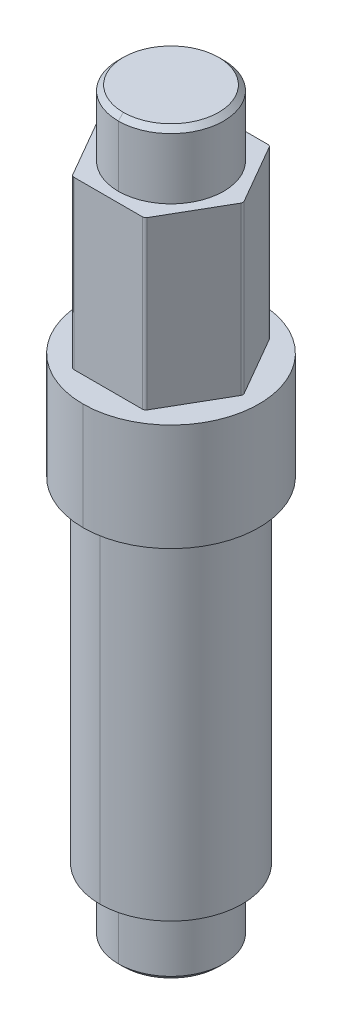
ISO-10303-21;
HEADER;
FILE_DESCRIPTION(('STEP AP214'),'2;1');
FILE_NAME('part.step','',(''),(''),'','','');
FILE_SCHEMA(('AUTOMOTIVE_DESIGN { 1 0 10303 214 1 1 1 1 }'));
ENDSEC;
DATA;
#1=APPLICATION_CONTEXT('core data for automotive mechanical design processes');
#2=APPLICATION_PROTOCOL_DEFINITION('international standard','automotive_design',2000,#1);
#3=PRODUCT_CONTEXT('',#1,'mechanical');
#4=PRODUCT('Part','Part','',(#3));
#5=PRODUCT_RELATED_PRODUCT_CATEGORY('part','',(#4));
#6=PRODUCT_DEFINITION_FORMATION('','',#4);
#7=PRODUCT_DEFINITION_CONTEXT('part definition',#1,'design');
#8=PRODUCT_DEFINITION('design','',#6,#7);
#9=PRODUCT_DEFINITION_SHAPE('','',#8);
#10=(LENGTH_UNIT() NAMED_UNIT(*) SI_UNIT(.MILLI.,.METRE.));
#11=(NAMED_UNIT(*) PLANE_ANGLE_UNIT() SI_UNIT($,.RADIAN.));
#12=(NAMED_UNIT(*) SI_UNIT($,.STERADIAN.) SOLID_ANGLE_UNIT());
#13=UNCERTAINTY_MEASURE_WITH_UNIT(LENGTH_MEASURE(1.E-05),#10,'distance_accuracy_value','');
#14=(GEOMETRIC_REPRESENTATION_CONTEXT(3) GLOBAL_UNCERTAINTY_ASSIGNED_CONTEXT((#13)) GLOBAL_UNIT_ASSIGNED_CONTEXT((#10,
#11,#12)) REPRESENTATION_CONTEXT('',''));
#15=CARTESIAN_POINT('',(0.,0.,0.));
#16=DIRECTION('',(0.,0.,1.));
#17=DIRECTION('',(1.,0.,0.));
#18=AXIS2_PLACEMENT_3D('',#15,#16,#17);
#19=CARTESIAN_POINT('',(0.,-4.618999906,0.));
#20=DIRECTION('',(0.,1.,0.));
#21=DIRECTION('',(0.,0.,1.));
#22=AXIS2_PLACEMENT_3D('',#19,#20,#21);
#23=CONICAL_SURFACE('',#22,4.000000001,0.78539816339745);
#24=DIRECTION('',(0.,0.707106781186546,-0.707106781186549));
#25=VECTOR('',#24,1.);
#26=CARTESIAN_POINT('',(0.,-4.618999906,-4.000000001));
#27=LINE('',#26,#25);
#28=CARTESIAN_POINT('',(0.,-4.999999906,-3.61900000099999));
#29=VERTEX_POINT('',#28);
#30=CARTESIAN_POINT('',(0.,-4.618999906,-4.000000001));
#31=VERTEX_POINT('',#30);
#32=EDGE_CURVE('E301',#29,#31,#27,.T.);
#33=ORIENTED_EDGE('',*,*,#32,.F.);
#34=CARTESIAN_POINT('',(0.,-4.999999906,0.));
#35=DIRECTION('',(0.,-1.,0.));
#36=DIRECTION('',(0.,0.,-1.));
#37=AXIS2_PLACEMENT_3D('',#34,#35,#36);
#38=CIRCLE('',#37,3.61900000099999);
#39=CARTESIAN_POINT('',(0.,-4.999999906,3.61900000099999));
#40=VERTEX_POINT('',#39);
#41=EDGE_CURVE('E255',#40,#29,#38,.T.);
#42=ORIENTED_EDGE('',*,*,#41,.F.);
#43=DIRECTION('',(0.,0.707106781186546,0.707106781186549));
#44=VECTOR('',#43,1.);
#45=CARTESIAN_POINT('',(0.,-4.618999906,4.000000001));
#46=LINE('',#45,#44);
#47=CARTESIAN_POINT('',(0.,-4.618999906,4.000000001));
#48=VERTEX_POINT('',#47);
#49=EDGE_CURVE('E264',#40,#48,#46,.T.);
#50=ORIENTED_EDGE('',*,*,#49,.T.);
#51=CARTESIAN_POINT('',(0.,-4.618999906,0.));
#52=DIRECTION('',(0.,1.,0.));
#53=DIRECTION('',(0.,0.,-1.));
#54=AXIS2_PLACEMENT_3D('',#51,#52,#53);
#55=CIRCLE('',#54,4.000000001);
#56=EDGE_CURVE('E235',#31,#48,#55,.T.);
#57=ORIENTED_EDGE('',*,*,#56,.F.);
#58=EDGE_LOOP('',(#33,#42,#50,#57));
#59=FACE_BOUND('',#58,.T.);
#60=ADVANCED_FACE('F16',(#59),#23,.T.);
#61=CARTESIAN_POINT('',(0.,51.177199906,0.));
#62=DIRECTION('',(0.,-1.,0.));
#63=DIRECTION('',(0.,0.,-1.));
#64=AXIS2_PLACEMENT_3D('',#61,#62,#63);
#65=CONICAL_SURFACE('',#64,3.61900000100001,0.785398163397453);
#66=DIRECTION('',(0.,-0.707106781186544,0.707106781186551));
#67=VECTOR('',#66,1.);
#68=CARTESIAN_POINT('',(0.,51.177199906,3.61900000100001));
#69=LINE('',#68,#67);
#70=CARTESIAN_POINT('',(0.,51.177199906,3.61900000100001));
#71=VERTEX_POINT('',#70);
#72=CARTESIAN_POINT('',(0.,50.796199906,4.000000001));
#73=VERTEX_POINT('',#72);
#74=EDGE_CURVE('E263',#71,#73,#69,.T.);
#75=ORIENTED_EDGE('',*,*,#74,.F.);
#76=CARTESIAN_POINT('',(0.,51.177199906,0.));
#77=DIRECTION('',(0.,1.,0.));
#78=DIRECTION('',(0.,0.,1.));
#79=AXIS2_PLACEMENT_3D('',#76,#77,#78);
#80=CIRCLE('',#79,3.61900000100001);
#81=CARTESIAN_POINT('',(0.,51.177199906,-3.61900000100001));
#82=VERTEX_POINT('',#81);
#83=EDGE_CURVE('E254',#82,#71,#80,.T.);
#84=ORIENTED_EDGE('',*,*,#83,.F.);
#85=DIRECTION('',(0.,-0.707106781186544,-0.707106781186551));
#86=VECTOR('',#85,1.);
#87=CARTESIAN_POINT('',(0.,51.177199906,-3.61900000100001));
#88=LINE('',#87,#86);
#89=CARTESIAN_POINT('',(0.,50.796199906,-4.000000001));
#90=VERTEX_POINT('',#89);
#91=EDGE_CURVE('E300',#82,#90,#88,.T.);
#92=ORIENTED_EDGE('',*,*,#91,.T.);
#93=CARTESIAN_POINT('',(0.,50.796199906,0.));
#94=DIRECTION('',(0.,-1.,0.));
#95=DIRECTION('',(0.,0.,1.));
#96=AXIS2_PLACEMENT_3D('',#93,#94,#95);
#97=CIRCLE('',#96,4.000000001);
#98=EDGE_CURVE('E11',#73,#90,#97,.T.);
#99=ORIENTED_EDGE('',*,*,#98,.F.);
#100=EDGE_LOOP('',(#75,#84,#92,#99));
#101=FACE_BOUND('',#100,.T.);
#102=ADVANCED_FACE('F513',(#101),#65,.T.);
#103=CARTESIAN_POINT('',(-6.6802,46.1772,0.));
#104=DIRECTION('',(0.,1.,0.));
#105=DIRECTION('',(1.,0.,0.));
#106=AXIS2_PLACEMENT_3D('',#103,#104,#105);
#107=PLANE('',#106);
#108=CARTESIAN_POINT('',(0.,46.1772,0.));
#109=DIRECTION('',(0.,1.,0.));
#110=DIRECTION('',(0.,0.,1.));
#111=AXIS2_PLACEMENT_3D('',#108,#109,#110);
#112=CIRCLE('',#111,4.000000001);
#113=CARTESIAN_POINT('',(0.,46.1772,4.000000001));
#114=VERTEX_POINT('',#113);
#115=CARTESIAN_POINT('',(0.,46.1772,-4.000000001));
#116=VERTEX_POINT('',#115);
#117=EDGE_CURVE('E295',#114,#116,#112,.T.);
#118=ORIENTED_EDGE('',*,*,#117,.F.);
#119=CARTESIAN_POINT('',(0.,46.1772,0.));
#120=DIRECTION('',(0.,1.,0.));
#121=DIRECTION('',(0.,0.,1.));
#122=AXIS2_PLACEMENT_3D('',#119,#120,#121);
#123=CIRCLE('',#122,4.000000001);
#124=EDGE_CURVE('E27',#116,#114,#123,.T.);
#125=ORIENTED_EDGE('',*,*,#124,.F.);
#126=EDGE_LOOP('',(#118,#125));
#127=FACE_BOUND('',#126,.T.);
#128=DIRECTION('',(0.5,0.,0.866025403784439));
#129=VECTOR('',#128,1.);
#130=CARTESIAN_POINT('',(-5.42593782984411,46.1772,0.127000000000003));
#131=LINE('',#130,#129);
#132=CARTESIAN_POINT('',(-5.42593782984411,46.1772,0.127000000000003));
#133=VERTEX_POINT('',#132);
#134=CARTESIAN_POINT('',(-2.82295414120268,46.1772,4.6355));
#135=VERTEX_POINT('',#134);
#136=EDGE_CURVE('E281',#133,#135,#131,.T.);
#137=ORIENTED_EDGE('',*,*,#136,.T.);
#138=CARTESIAN_POINT('',(-2.60298368864143,46.1772,4.5085));
#139=DIRECTION('',(0.,1.,0.));
#140=DIRECTION('',(0.,0.,1.));
#141=AXIS2_PLACEMENT_3D('',#138,#139,#140);
#142=CIRCLE('',#141,0.254);
#143=CARTESIAN_POINT('',(-2.60298368864143,46.1772,4.7625));
#144=VERTEX_POINT('',#143);
#145=EDGE_CURVE('E341',#135,#144,#142,.T.);
#146=ORIENTED_EDGE('',*,*,#145,.T.);
#147=DIRECTION('',(1.,0.,0.));
#148=VECTOR('',#147,1.);
#149=CARTESIAN_POINT('',(-2.60298368864143,46.1772,4.7625));
#150=LINE('',#149,#148);
#151=CARTESIAN_POINT('',(2.60298368864142,46.1772,4.7625));
#152=VERTEX_POINT('',#151);
#153=EDGE_CURVE('E42',#144,#152,#150,.T.);
#154=ORIENTED_EDGE('',*,*,#153,.T.);
#155=CARTESIAN_POINT('',(2.60298368864142,46.1772,4.5085));
#156=DIRECTION('',(0.,1.,0.));
#157=DIRECTION('',(0.,0.,1.));
#158=AXIS2_PLACEMENT_3D('',#155,#156,#157);
#159=CIRCLE('',#158,0.254);
#160=CARTESIAN_POINT('',(2.82295414120268,46.1772,4.6355));
#161=VERTEX_POINT('',#160);
#162=EDGE_CURVE('E318',#152,#161,#159,.T.);
#163=ORIENTED_EDGE('',*,*,#162,.T.);
#164=DIRECTION('',(0.5,0.,-0.866025403784439));
#165=VECTOR('',#164,1.);
#166=CARTESIAN_POINT('',(2.82295414120268,46.1772,4.6355));
#167=LINE('',#166,#165);
#168=CARTESIAN_POINT('',(5.4259378298441,46.1772,0.126999999999999));
#169=VERTEX_POINT('',#168);
#170=EDGE_CURVE('E330',#161,#169,#167,.T.);
#171=ORIENTED_EDGE('',*,*,#170,.T.);
#172=CARTESIAN_POINT('',(5.20596737728286,46.1772,0.));
#173=DIRECTION('',(0.,1.,0.));
#174=DIRECTION('',(0.,0.,1.));
#175=AXIS2_PLACEMENT_3D('',#172,#173,#174);
#176=CIRCLE('',#175,0.254);
#177=CARTESIAN_POINT('',(5.4259378298441,46.1772,-0.127000000000003));
#178=VERTEX_POINT('',#177);
#179=EDGE_CURVE('E271',#169,#178,#176,.T.);
#180=ORIENTED_EDGE('',*,*,#179,.T.);
#181=DIRECTION('',(-0.5,0.,-0.866025403784439));
#182=VECTOR('',#181,1.);
#183=CARTESIAN_POINT('',(5.4259378298441,46.1772,-0.127000000000003));
#184=LINE('',#183,#182);
#185=CARTESIAN_POINT('',(2.82295414120266,46.1772,-4.6355));
#186=VERTEX_POINT('',#185);
#187=EDGE_CURVE('E345',#178,#186,#184,.T.);
#188=ORIENTED_EDGE('',*,*,#187,.T.);
#189=CARTESIAN_POINT('',(2.60298368864142,46.1772,-4.5085));
#190=DIRECTION('',(0.,1.,0.));
#191=DIRECTION('',(0.,0.,1.));
#192=AXIS2_PLACEMENT_3D('',#189,#190,#191);
#193=CIRCLE('',#192,0.254);
#194=CARTESIAN_POINT('',(2.60298368864142,46.1772,-4.7625));
#195=VERTEX_POINT('',#194);
#196=EDGE_CURVE('E290',#186,#195,#193,.T.);
#197=ORIENTED_EDGE('',*,*,#196,.T.);
#198=DIRECTION('',(-1.,0.,0.));
#199=VECTOR('',#198,1.);
#200=CARTESIAN_POINT('',(2.60298368864142,46.1772,-4.7625));
#201=LINE('',#200,#199);
#202=CARTESIAN_POINT('',(-2.60298368864143,46.1772,-4.7625));
#203=VERTEX_POINT('',#202);
#204=EDGE_CURVE('E326',#195,#203,#201,.T.);
#205=ORIENTED_EDGE('',*,*,#204,.T.);
#206=CARTESIAN_POINT('',(-2.60298368864143,46.1772,-4.5085));
#207=DIRECTION('',(0.,1.,0.));
#208=DIRECTION('',(0.,0.,1.));
#209=AXIS2_PLACEMENT_3D('',#206,#207,#208);
#210=CIRCLE('',#209,0.254);
#211=CARTESIAN_POINT('',(-2.82295414120268,46.1772,-4.6355));
#212=VERTEX_POINT('',#211);
#213=EDGE_CURVE('E314',#203,#212,#210,.T.);
#214=ORIENTED_EDGE('',*,*,#213,.T.);
#215=DIRECTION('',(-0.5,0.,0.866025403784439));
#216=VECTOR('',#215,1.);
#217=CARTESIAN_POINT('',(-2.82295414120268,46.1772,-4.6355));
#218=LINE('',#217,#216);
#219=CARTESIAN_POINT('',(-5.42593782984411,46.1772,-0.127));
#220=VERTEX_POINT('',#219);
#221=EDGE_CURVE('E211',#212,#220,#218,.T.);
#222=ORIENTED_EDGE('',*,*,#221,.T.);
#223=CARTESIAN_POINT('',(-5.20596737728286,46.1772,0.));
#224=DIRECTION('',(0.,1.,0.));
#225=DIRECTION('',(0.,0.,1.));
#226=AXIS2_PLACEMENT_3D('',#223,#224,#225);
#227=CIRCLE('',#226,0.254);
#228=EDGE_CURVE('E207',#220,#133,#227,.T.);
#229=ORIENTED_EDGE('',*,*,#228,.T.);
#230=EDGE_LOOP('',(#137,#146,#154,#163,#171,#180,#188,#197,#205,#214,#222,#229));
#231=FACE_BOUND('',#230,.T.);
#232=ADVANCED_FACE('F459',(#127,#231),#107,.T.);
#233=CARTESIAN_POINT('',(0.,0.,0.));
#234=DIRECTION('',(0.,1.,0.));
#235=DIRECTION('',(0.,0.,1.));
#236=AXIS2_PLACEMENT_3D('',#233,#234,#235);
#237=CYLINDRICAL_SURFACE('',#236,4.000000001);
#238=DIRECTION('',(0.,1.,0.));
#239=VECTOR('',#238,1.);
#240=CARTESIAN_POINT('',(0.,0.,-4.000000001));
#241=LINE('',#240,#239);
#242=EDGE_CURVE('E299',#116,#90,#241,.T.);
#243=ORIENTED_EDGE('',*,*,#242,.F.);
#244=ORIENTED_EDGE('',*,*,#124,.T.);
#245=DIRECTION('',(0.,1.,0.));
#246=VECTOR('',#245,1.);
#247=CARTESIAN_POINT('',(0.,0.,4.000000001));
#248=LINE('',#247,#246);
#249=EDGE_CURVE('E270',#114,#73,#248,.T.);
#250=ORIENTED_EDGE('',*,*,#249,.T.);
#251=ORIENTED_EDGE('',*,*,#98,.T.);
#252=EDGE_LOOP('',(#243,#244,#250,#251));
#253=FACE_BOUND('',#252,.T.);
#254=ADVANCED_FACE('F544',(#253),#237,.T.);
#255=CARTESIAN_POINT('',(-4.000000001,51.177199906,0.));
#256=DIRECTION('',(0.,1.,0.));
#257=DIRECTION('',(1.,0.,0.));
#258=AXIS2_PLACEMENT_3D('',#255,#256,#257);
#259=PLANE('',#258);
#260=ORIENTED_EDGE('',*,*,#83,.T.);
#261=CARTESIAN_POINT('',(0.,51.177199906,0.));
#262=DIRECTION('',(0.,1.,0.));
#263=DIRECTION('',(0.,0.,1.));
#264=AXIS2_PLACEMENT_3D('',#261,#262,#263);
#265=CIRCLE('',#264,3.61900000100001);
#266=EDGE_CURVE('E259',#71,#82,#265,.T.);
#267=ORIENTED_EDGE('',*,*,#266,.T.);
#268=EDGE_LOOP('',(#260,#267));
#269=FACE_BOUND('',#268,.T.);
#270=ADVANCED_FACE('F541',(#269),#259,.T.);
#271=CARTESIAN_POINT('',(-2.60298368864143,33.528,4.7625));
#272=DIRECTION('',(0.,0.,1.));
#273=DIRECTION('',(1.,0.,0.));
#274=AXIS2_PLACEMENT_3D('',#271,#272,#273);
#275=PLANE('',#274);
#276=ORIENTED_EDGE('',*,*,#153,.F.);
#277=DIRECTION('',(0.,1.,0.));
#278=VECTOR('',#277,1.);
#279=CARTESIAN_POINT('',(-2.60298368864143,33.528,4.7625));
#280=LINE('',#279,#278);
#281=CARTESIAN_POINT('',(-2.60298368864143,33.528,4.7625));
#282=VERTEX_POINT('',#281);
#283=EDGE_CURVE('E285',#282,#144,#280,.T.);
#284=ORIENTED_EDGE('',*,*,#283,.F.);
#285=DIRECTION('',(1.,0.,0.));
#286=VECTOR('',#285,1.);
#287=CARTESIAN_POINT('',(-2.60298368864143,33.528,4.7625));
#288=LINE('',#287,#286);
#289=CARTESIAN_POINT('',(2.60298368864142,33.528,4.7625));
#290=VERTEX_POINT('',#289);
#291=EDGE_CURVE('E358',#282,#290,#288,.T.);
#292=ORIENTED_EDGE('',*,*,#291,.T.);
#293=DIRECTION('',(0.,1.,0.));
#294=VECTOR('',#293,1.);
#295=CARTESIAN_POINT('',(2.60298368864142,33.528,4.7625));
#296=LINE('',#295,#294);
#297=EDGE_CURVE('E321',#290,#152,#296,.T.);
#298=ORIENTED_EDGE('',*,*,#297,.T.);
#299=EDGE_LOOP('',(#276,#284,#292,#298));
#300=FACE_BOUND('',#299,.T.);
#301=ADVANCED_FACE('F452',(#300),#275,.T.);
#302=CARTESIAN_POINT('',(2.60298368864142,33.528,4.5085));
#303=DIRECTION('',(0.,1.,0.));
#304=DIRECTION('',(0.,0.,1.));
#305=AXIS2_PLACEMENT_3D('',#302,#303,#304);
#306=CYLINDRICAL_SURFACE('',#305,0.254);
#307=ORIENTED_EDGE('',*,*,#162,.F.);
#308=ORIENTED_EDGE('',*,*,#297,.F.);
#309=CARTESIAN_POINT('',(2.60298368864142,33.528,4.5085));
#310=DIRECTION('',(0.,1.,0.));
#311=DIRECTION('',(0.,0.,1.));
#312=AXIS2_PLACEMENT_3D('',#309,#310,#311);
#313=CIRCLE('',#312,0.254);
#314=CARTESIAN_POINT('',(2.82295414120268,33.528,4.6355));
#315=VERTEX_POINT('',#314);
#316=EDGE_CURVE('E365',#290,#315,#313,.T.);
#317=ORIENTED_EDGE('',*,*,#316,.T.);
#318=DIRECTION('',(0.,1.,0.));
#319=VECTOR('',#318,1.);
#320=CARTESIAN_POINT('',(2.82295414120268,33.528,4.6355));
#321=LINE('',#320,#319);
#322=EDGE_CURVE('E322',#315,#161,#321,.T.);
#323=ORIENTED_EDGE('',*,*,#322,.T.);
#324=EDGE_LOOP('',(#307,#308,#317,#323));
#325=FACE_BOUND('',#324,.T.);
#326=ADVANCED_FACE('F457',(#325),#306,.T.);
#327=CARTESIAN_POINT('',(2.82295414120268,33.528,4.6355));
#328=DIRECTION('',(0.866025403784439,0.,0.5));
#329=DIRECTION('',(0.,-1.,0.));
#330=AXIS2_PLACEMENT_3D('',#327,#328,#329);
#331=PLANE('',#330);
#332=ORIENTED_EDGE('',*,*,#170,.F.);
#333=ORIENTED_EDGE('',*,*,#322,.F.);
#334=DIRECTION('',(0.5,0.,-0.866025403784439));
#335=VECTOR('',#334,1.);
#336=CARTESIAN_POINT('',(2.82295414120268,33.528,4.6355));
#337=LINE('',#336,#335);
#338=CARTESIAN_POINT('',(5.4259378298441,33.528,0.126999999999999));
#339=VERTEX_POINT('',#338);
#340=EDGE_CURVE('E251',#315,#339,#337,.T.);
#341=ORIENTED_EDGE('',*,*,#340,.T.);
#342=DIRECTION('',(0.,1.,0.));
#343=VECTOR('',#342,1.);
#344=CARTESIAN_POINT('',(5.4259378298441,33.528,0.126999999999999));
#345=LINE('',#344,#343);
#346=EDGE_CURVE('E20',#339,#169,#345,.T.);
#347=ORIENTED_EDGE('',*,*,#346,.T.);
#348=EDGE_LOOP('',(#332,#333,#341,#347));
#349=FACE_BOUND('',#348,.T.);
#350=ADVANCED_FACE('F463',(#349),#331,.T.);
#351=CARTESIAN_POINT('',(5.20596737728286,33.528,0.));
#352=DIRECTION('',(0.,1.,0.));
#353=DIRECTION('',(0.,0.,1.));
#354=AXIS2_PLACEMENT_3D('',#351,#352,#353);
#355=CYLINDRICAL_SURFACE('',#354,0.254);
#356=ORIENTED_EDGE('',*,*,#179,.F.);
#357=ORIENTED_EDGE('',*,*,#346,.F.);
#358=CARTESIAN_POINT('',(5.20596737728286,33.528,0.));
#359=DIRECTION('',(0.,1.,0.));
#360=DIRECTION('',(0.,0.,1.));
#361=AXIS2_PLACEMENT_3D('',#358,#359,#360);
#362=CIRCLE('',#361,0.254);
#363=CARTESIAN_POINT('',(5.4259378298441,33.528,-0.127000000000003));
#364=VERTEX_POINT('',#363);
#365=EDGE_CURVE('E247',#339,#364,#362,.T.);
#366=ORIENTED_EDGE('',*,*,#365,.T.);
#367=DIRECTION('',(0.,1.,0.));
#368=VECTOR('',#367,1.);
#369=CARTESIAN_POINT('',(5.4259378298441,33.528,-0.127000000000003));
#370=LINE('',#369,#368);
#371=EDGE_CURVE('E274',#364,#178,#370,.T.);
#372=ORIENTED_EDGE('',*,*,#371,.T.);
#373=EDGE_LOOP('',(#356,#357,#366,#372));
#374=FACE_BOUND('',#373,.T.);
#375=ADVANCED_FACE('F467',(#374),#355,.T.);
#376=CARTESIAN_POINT('',(5.4259378298441,33.528,-0.127000000000003));
#377=DIRECTION('',(0.866025403784439,0.,-0.5));
#378=DIRECTION('',(0.,-1.,0.));
#379=AXIS2_PLACEMENT_3D('',#376,#377,#378);
#380=PLANE('',#379);
#381=ORIENTED_EDGE('',*,*,#187,.F.);
#382=ORIENTED_EDGE('',*,*,#371,.F.);
#383=DIRECTION('',(-0.5,0.,-0.866025403784439));
#384=VECTOR('',#383,1.);
#385=CARTESIAN_POINT('',(5.4259378298441,33.528,-0.127000000000003));
#386=LINE('',#385,#384);
#387=CARTESIAN_POINT('',(2.82295414120266,33.528,-4.6355));
#388=VERTEX_POINT('',#387);
#389=EDGE_CURVE('E245',#364,#388,#386,.T.);
#390=ORIENTED_EDGE('',*,*,#389,.T.);
#391=DIRECTION('',(0.,1.,0.));
#392=VECTOR('',#391,1.);
#393=CARTESIAN_POINT('',(2.82295414120266,33.528,-4.6355));
#394=LINE('',#393,#392);
#395=EDGE_CURVE('E293',#388,#186,#394,.T.);
#396=ORIENTED_EDGE('',*,*,#395,.T.);
#397=EDGE_LOOP('',(#381,#382,#390,#396));
#398=FACE_BOUND('',#397,.T.);
#399=ADVANCED_FACE('F422',(#398),#380,.T.);
#400=CARTESIAN_POINT('',(2.60298368864142,33.528,-4.5085));
#401=DIRECTION('',(0.,1.,0.));
#402=DIRECTION('',(0.,0.,1.));
#403=AXIS2_PLACEMENT_3D('',#400,#401,#402);
#404=CYLINDRICAL_SURFACE('',#403,0.254);
#405=ORIENTED_EDGE('',*,*,#196,.F.);
#406=ORIENTED_EDGE('',*,*,#395,.F.);
#407=CARTESIAN_POINT('',(2.60298368864142,33.528,-4.5085));
#408=DIRECTION('',(0.,1.,0.));
#409=DIRECTION('',(0.,0.,1.));
#410=AXIS2_PLACEMENT_3D('',#407,#408,#409);
#411=CIRCLE('',#410,0.254);
#412=CARTESIAN_POINT('',(2.60298368864142,33.528,-4.7625));
#413=VERTEX_POINT('',#412);
#414=EDGE_CURVE('E241',#388,#413,#411,.T.);
#415=ORIENTED_EDGE('',*,*,#414,.T.);
#416=DIRECTION('',(0.,1.,0.));
#417=VECTOR('',#416,1.);
#418=CARTESIAN_POINT('',(2.60298368864142,33.528,-4.7625));
#419=LINE('',#418,#417);
#420=EDGE_CURVE('E294',#413,#195,#419,.T.);
#421=ORIENTED_EDGE('',*,*,#420,.T.);
#422=EDGE_LOOP('',(#405,#406,#415,#421));
#423=FACE_BOUND('',#422,.T.);
#424=ADVANCED_FACE('F418',(#423),#404,.T.);
#425=CARTESIAN_POINT('',(2.60298368864142,33.528,-4.7625));
#426=DIRECTION('',(0.,0.,-1.));
#427=DIRECTION('',(-1.,0.,0.));
#428=AXIS2_PLACEMENT_3D('',#425,#426,#427);
#429=PLANE('',#428);
#430=ORIENTED_EDGE('',*,*,#204,.F.);
#431=ORIENTED_EDGE('',*,*,#420,.F.);
#432=DIRECTION('',(-1.,0.,0.));
#433=VECTOR('',#432,1.);
#434=CARTESIAN_POINT('',(2.60298368864142,33.528,-4.7625));
#435=LINE('',#434,#433);
#436=CARTESIAN_POINT('',(-2.60298368864143,33.528,-4.7625));
#437=VERTEX_POINT('',#436);
#438=EDGE_CURVE('E246',#413,#437,#435,.T.);
#439=ORIENTED_EDGE('',*,*,#438,.T.);
#440=DIRECTION('',(0.,1.,0.));
#441=VECTOR('',#440,1.);
#442=CARTESIAN_POINT('',(-2.60298368864143,33.528,-4.7625));
#443=LINE('',#442,#441);
#444=EDGE_CURVE('E317',#437,#203,#443,.T.);
#445=ORIENTED_EDGE('',*,*,#444,.T.);
#446=EDGE_LOOP('',(#430,#431,#439,#445));
#447=FACE_BOUND('',#446,.T.);
#448=ADVANCED_FACE('F415',(#447),#429,.T.);
#449=CARTESIAN_POINT('',(-2.60298368864143,33.528,-4.5085));
#450=DIRECTION('',(0.,1.,0.));
#451=DIRECTION('',(0.,0.,1.));
#452=AXIS2_PLACEMENT_3D('',#449,#450,#451);
#453=CYLINDRICAL_SURFACE('',#452,0.254);
#454=ORIENTED_EDGE('',*,*,#213,.F.);
#455=ORIENTED_EDGE('',*,*,#444,.F.);
#456=CARTESIAN_POINT('',(-2.60298368864143,33.528,-4.5085));
#457=DIRECTION('',(0.,1.,0.));
#458=DIRECTION('',(0.,0.,1.));
#459=AXIS2_PLACEMENT_3D('',#456,#457,#458);
#460=CIRCLE('',#459,0.254);
#461=CARTESIAN_POINT('',(-2.82295414120268,33.528,-4.6355));
#462=VERTEX_POINT('',#461);
#463=EDGE_CURVE('E222',#437,#462,#460,.T.);
#464=ORIENTED_EDGE('',*,*,#463,.T.);
#465=DIRECTION('',(0.,1.,0.));
#466=VECTOR('',#465,1.);
#467=CARTESIAN_POINT('',(-2.82295414120268,33.528,-4.6355));
#468=LINE('',#467,#466);
#469=EDGE_CURVE('E217',#462,#212,#468,.T.);
#470=ORIENTED_EDGE('',*,*,#469,.T.);
#471=EDGE_LOOP('',(#454,#455,#464,#470));
#472=FACE_BOUND('',#471,.T.);
#473=ADVANCED_FACE('F409',(#472),#453,.T.);
#474=CARTESIAN_POINT('',(-2.82295414120268,33.528,-4.6355));
#475=DIRECTION('',(-0.866025403784439,0.,-0.5));
#476=DIRECTION('',(-0.5,0.,0.866025403784439));
#477=AXIS2_PLACEMENT_3D('',#474,#475,#476);
#478=PLANE('',#477);
#479=ORIENTED_EDGE('',*,*,#221,.F.);
#480=ORIENTED_EDGE('',*,*,#469,.F.);
#481=DIRECTION('',(-0.5,0.,0.866025403784439));
#482=VECTOR('',#481,1.);
#483=CARTESIAN_POINT('',(-2.82295414120268,33.528,-4.6355));
#484=LINE('',#483,#482);
#485=CARTESIAN_POINT('',(-5.42593782984411,33.528,-0.127));
#486=VERTEX_POINT('',#485);
#487=EDGE_CURVE('E214',#462,#486,#484,.T.);
#488=ORIENTED_EDGE('',*,*,#487,.T.);
#489=DIRECTION('',(0.,1.,0.));
#490=VECTOR('',#489,1.);
#491=CARTESIAN_POINT('',(-5.42593782984411,33.528,-0.127));
#492=LINE('',#491,#490);
#493=EDGE_CURVE('E200',#486,#220,#492,.T.);
#494=ORIENTED_EDGE('',*,*,#493,.T.);
#495=EDGE_LOOP('',(#479,#480,#488,#494));
#496=FACE_BOUND('',#495,.T.);
#497=ADVANCED_FACE('F215',(#496),#478,.T.);
#498=CARTESIAN_POINT('',(-5.20596737728286,33.528,0.));
#499=DIRECTION('',(0.,1.,0.));
#500=DIRECTION('',(0.,0.,1.));
#501=AXIS2_PLACEMENT_3D('',#498,#499,#500);
#502=CYLINDRICAL_SURFACE('',#501,0.254);
#503=ORIENTED_EDGE('',*,*,#228,.F.);
#504=ORIENTED_EDGE('',*,*,#493,.F.);
#505=CARTESIAN_POINT('',(-5.20596737728286,33.528,0.));
#506=DIRECTION('',(0.,1.,0.));
#507=DIRECTION('',(0.,0.,1.));
#508=AXIS2_PLACEMENT_3D('',#505,#506,#507);
#509=CIRCLE('',#508,0.254);
#510=CARTESIAN_POINT('',(-5.42593782984411,33.528,0.127000000000003));
#511=VERTEX_POINT('',#510);
#512=EDGE_CURVE('E205',#486,#511,#509,.T.);
#513=ORIENTED_EDGE('',*,*,#512,.T.);
#514=DIRECTION('',(0.,1.,0.));
#515=VECTOR('',#514,1.);
#516=CARTESIAN_POINT('',(-5.42593782984411,33.528,0.127000000000003));
#517=LINE('',#516,#515);
#518=EDGE_CURVE('E284',#511,#133,#517,.T.);
#519=ORIENTED_EDGE('',*,*,#518,.T.);
#520=EDGE_LOOP('',(#503,#504,#513,#519));
#521=FACE_BOUND('',#520,.T.);
#522=ADVANCED_FACE('F202',(#521),#502,.T.);
#523=CARTESIAN_POINT('',(-5.42593782984411,33.528,0.127000000000003));
#524=DIRECTION('',(-0.866025403784439,0.,0.5));
#525=DIRECTION('',(0.,1.,0.));
#526=AXIS2_PLACEMENT_3D('',#523,#524,#525);
#527=PLANE('',#526);
#528=ORIENTED_EDGE('',*,*,#136,.F.);
#529=ORIENTED_EDGE('',*,*,#518,.F.);
#530=DIRECTION('',(0.5,0.,0.866025403784439));
#531=VECTOR('',#530,1.);
#532=CARTESIAN_POINT('',(-5.42593782984411,33.528,0.127000000000003));
#533=LINE('',#532,#531);
#534=CARTESIAN_POINT('',(-2.82295414120268,33.528,4.6355));
#535=VERTEX_POINT('',#534);
#536=EDGE_CURVE('E228',#511,#535,#533,.T.);
#537=ORIENTED_EDGE('',*,*,#536,.T.);
#538=DIRECTION('',(0.,1.,0.));
#539=VECTOR('',#538,1.);
#540=CARTESIAN_POINT('',(-2.82295414120268,33.528,4.6355));
#541=LINE('',#540,#539);
#542=EDGE_CURVE('E337',#535,#135,#541,.T.);
#543=ORIENTED_EDGE('',*,*,#542,.T.);
#544=EDGE_LOOP('',(#528,#529,#537,#543));
#545=FACE_BOUND('',#544,.T.);
#546=ADVANCED_FACE('F531',(#545),#527,.T.);
#547=CARTESIAN_POINT('',(-2.60298368864143,33.528,4.5085));
#548=DIRECTION('',(0.,1.,0.));
#549=DIRECTION('',(0.,0.,1.));
#550=AXIS2_PLACEMENT_3D('',#547,#548,#549);
#551=CYLINDRICAL_SURFACE('',#550,0.254);
#552=ORIENTED_EDGE('',*,*,#145,.F.);
#553=ORIENTED_EDGE('',*,*,#542,.F.);
#554=CARTESIAN_POINT('',(-2.60298368864143,33.528,4.5085));
#555=DIRECTION('',(0.,1.,0.));
#556=DIRECTION('',(0.,0.,1.));
#557=AXIS2_PLACEMENT_3D('',#554,#555,#556);
#558=CIRCLE('',#557,0.254);
#559=EDGE_CURVE('E354',#535,#282,#558,.T.);
#560=ORIENTED_EDGE('',*,*,#559,.T.);
#561=ORIENTED_EDGE('',*,*,#283,.T.);
#562=EDGE_LOOP('',(#552,#553,#560,#561));
#563=FACE_BOUND('',#562,.T.);
#564=ADVANCED_FACE('F528',(#563),#551,.T.);
#565=CARTESIAN_POINT('',(0.,33.528,0.));
#566=DIRECTION('',(0.,1.,0.));
#567=DIRECTION('',(1.,0.,0.));
#568=AXIS2_PLACEMENT_3D('',#565,#566,#567);
#569=PLANE('',#568);
#570=ORIENTED_EDGE('',*,*,#536,.F.);
#571=ORIENTED_EDGE('',*,*,#512,.F.);
#572=ORIENTED_EDGE('',*,*,#487,.F.);
#573=ORIENTED_EDGE('',*,*,#463,.F.);
#574=ORIENTED_EDGE('',*,*,#438,.F.);
#575=ORIENTED_EDGE('',*,*,#414,.F.);
#576=ORIENTED_EDGE('',*,*,#389,.F.);
#577=ORIENTED_EDGE('',*,*,#365,.F.);
#578=ORIENTED_EDGE('',*,*,#340,.F.);
#579=ORIENTED_EDGE('',*,*,#316,.F.);
#580=ORIENTED_EDGE('',*,*,#291,.F.);
#581=ORIENTED_EDGE('',*,*,#559,.F.);
#582=EDGE_LOOP('',(#570,#571,#572,#573,#574,#575,#576,#577,#578,#579,#580,#581));
#583=FACE_BOUND('',#582,.T.);
#584=CARTESIAN_POINT('',(0.,33.528,0.));
#585=DIRECTION('',(0.,-1.,0.));
#586=DIRECTION('',(0.,0.,1.));
#587=AXIS2_PLACEMENT_3D('',#584,#585,#586);
#588=CIRCLE('',#587,6.6802);
#589=CARTESIAN_POINT('',(0.,33.528,6.6802));
#590=VERTEX_POINT('',#589);
#591=CARTESIAN_POINT('',(0.,33.528,-6.6802));
#592=VERTEX_POINT('',#591);
#593=EDGE_CURVE('E312',#590,#592,#588,.T.);
#594=ORIENTED_EDGE('',*,*,#593,.F.);
#595=CARTESIAN_POINT('',(0.,33.528,0.));
#596=DIRECTION('',(0.,-1.,0.));
#597=DIRECTION('',(0.,0.,1.));
#598=AXIS2_PLACEMENT_3D('',#595,#596,#597);
#599=CIRCLE('',#598,6.6802);
#600=EDGE_CURVE('E441',#592,#590,#599,.T.);
#601=ORIENTED_EDGE('',*,*,#600,.F.);
#602=EDGE_LOOP('',(#594,#601));
#603=FACE_BOUND('',#602,.T.);
#604=ADVANCED_FACE('F224',(#583,#603),#569,.T.);
#605=CARTESIAN_POINT('',(0.,0.,0.));
#606=DIRECTION('',(0.,1.,0.));
#607=DIRECTION('',(0.,0.,1.));
#608=AXIS2_PLACEMENT_3D('',#605,#606,#607);
#609=CYLINDRICAL_SURFACE('',#608,4.000000001);
#610=DIRECTION('',(0.,1.,0.));
#611=VECTOR('',#610,1.);
#612=CARTESIAN_POINT('',(0.,0.,-4.000000001));
#613=LINE('',#612,#611);
#614=CARTESIAN_POINT('',(0.,0.,-4.000000001));
#615=VERTEX_POINT('',#614);
#616=EDGE_CURVE('E265',#31,#615,#613,.T.);
#617=ORIENTED_EDGE('',*,*,#616,.F.);
#618=ORIENTED_EDGE('',*,*,#56,.T.);
#619=DIRECTION('',(0.,1.,0.));
#620=VECTOR('',#619,1.);
#621=CARTESIAN_POINT('',(0.,0.,4.000000001));
#622=LINE('',#621,#620);
#623=CARTESIAN_POINT('',(0.,0.,4.000000001));
#624=VERTEX_POINT('',#623);
#625=EDGE_CURVE('E280',#48,#624,#622,.T.);
#626=ORIENTED_EDGE('',*,*,#625,.T.);
#627=CARTESIAN_POINT('',(0.,0.,0.));
#628=DIRECTION('',(0.,1.,0.));
#629=DIRECTION('',(0.,0.,1.));
#630=AXIS2_PLACEMENT_3D('',#627,#628,#629);
#631=CIRCLE('',#630,4.000000001);
#632=EDGE_CURVE('E286',#615,#624,#631,.T.);
#633=ORIENTED_EDGE('',*,*,#632,.F.);
#634=EDGE_LOOP('',(#617,#618,#626,#633));
#635=FACE_BOUND('',#634,.T.);
#636=ADVANCED_FACE('F540',(#635),#609,.T.);
#637=CARTESIAN_POINT('',(-4.000000001,-4.999999906,0.));
#638=DIRECTION('',(0.,-1.,0.));
#639=DIRECTION('',(0.,0.,-1.));
#640=AXIS2_PLACEMENT_3D('',#637,#638,#639);
#641=PLANE('',#640);
#642=ORIENTED_EDGE('',*,*,#41,.T.);
#643=CARTESIAN_POINT('',(0.,-4.999999906,0.));
#644=DIRECTION('',(0.,-1.,0.));
#645=DIRECTION('',(0.,0.,-1.));
#646=AXIS2_PLACEMENT_3D('',#643,#644,#645);
#647=CIRCLE('',#646,3.61900000099999);
#648=EDGE_CURVE('E306',#29,#40,#647,.T.);
#649=ORIENTED_EDGE('',*,*,#648,.T.);
#650=EDGE_LOOP('',(#642,#649));
#651=FACE_BOUND('',#650,.T.);
#652=ADVANCED_FACE('F764',(#651),#641,.T.);
#653=CARTESIAN_POINT('',(-5.3975,25.4,0.));
#654=DIRECTION('',(0.,-1.,0.));
#655=DIRECTION('',(0.,0.,-1.));
#656=AXIS2_PLACEMENT_3D('',#653,#654,#655);
#657=PLANE('',#656);
#658=CARTESIAN_POINT('',(0.,25.4,0.));
#659=DIRECTION('',(0.,1.,0.));
#660=DIRECTION('',(0.,0.,1.));
#661=AXIS2_PLACEMENT_3D('',#658,#659,#660);
#662=CIRCLE('',#661,5.3975);
#663=CARTESIAN_POINT('',(0.,25.4,5.3975));
#664=VERTEX_POINT('',#663);
#665=CARTESIAN_POINT('',(0.,25.4,-5.3975));
#666=VERTEX_POINT('',#665);
#667=EDGE_CURVE('E349',#664,#666,#662,.T.);
#668=ORIENTED_EDGE('',*,*,#667,.T.);
#669=CARTESIAN_POINT('',(0.,25.4,0.));
#670=DIRECTION('',(0.,1.,0.));
#671=DIRECTION('',(0.,0.,1.));
#672=AXIS2_PLACEMENT_3D('',#669,#670,#671);
#673=CIRCLE('',#672,5.3975);
#674=EDGE_CURVE('E258',#666,#664,#673,.T.);
#675=ORIENTED_EDGE('',*,*,#674,.T.);
#676=EDGE_LOOP('',(#668,#675));
#677=FACE_BOUND('',#676,.T.);
#678=CARTESIAN_POINT('',(0.,25.4,0.));
#679=DIRECTION('',(0.,1.,0.));
#680=DIRECTION('',(0.,0.,1.));
#681=AXIS2_PLACEMENT_3D('',#678,#679,#680);
#682=CIRCLE('',#681,6.6802);
#683=CARTESIAN_POINT('',(0.,25.4,6.6802));
#684=VERTEX_POINT('',#683);
#685=CARTESIAN_POINT('',(0.,25.4,-6.6802));
#686=VERTEX_POINT('',#685);
#687=EDGE_CURVE('E434',#684,#686,#682,.T.);
#688=ORIENTED_EDGE('',*,*,#687,.F.);
#689=CARTESIAN_POINT('',(0.,25.4,0.));
#690=DIRECTION('',(0.,1.,0.));
#691=DIRECTION('',(0.,0.,1.));
#692=AXIS2_PLACEMENT_3D('',#689,#690,#691);
#693=CIRCLE('',#692,6.6802);
#694=EDGE_CURVE('E309',#686,#684,#693,.T.);
#695=ORIENTED_EDGE('',*,*,#694,.F.);
#696=EDGE_LOOP('',(#688,#695));
#697=FACE_BOUND('',#696,.T.);
#698=ADVANCED_FACE('F507',(#677,#697),#657,.T.);
#699=CARTESIAN_POINT('',(0.,0.,0.));
#700=DIRECTION('',(0.,1.,0.));
#701=DIRECTION('',(0.,0.,1.));
#702=AXIS2_PLACEMENT_3D('',#699,#700,#701);
#703=CYLINDRICAL_SURFACE('',#702,5.3975);
#704=DIRECTION('',(0.,1.,0.));
#705=VECTOR('',#704,1.);
#706=CARTESIAN_POINT('',(0.,0.,-5.3975));
#707=LINE('',#706,#705);
#708=CARTESIAN_POINT('',(0.,0.,-5.3975));
#709=VERTEX_POINT('',#708);
#710=EDGE_CURVE('E279',#709,#666,#707,.T.);
#711=ORIENTED_EDGE('',*,*,#710,.F.);
#712=CARTESIAN_POINT('',(0.,0.,0.));
#713=DIRECTION('',(0.,1.,0.));
#714=DIRECTION('',(0.,0.,1.));
#715=AXIS2_PLACEMENT_3D('',#712,#713,#714);
#716=CIRCLE('',#715,5.3975);
#717=CARTESIAN_POINT('',(0.,0.,5.3975));
#718=VERTEX_POINT('',#717);
#719=EDGE_CURVE('E289',#709,#718,#716,.T.);
#720=ORIENTED_EDGE('',*,*,#719,.T.);
#721=DIRECTION('',(0.,1.,0.));
#722=VECTOR('',#721,1.);
#723=CARTESIAN_POINT('',(0.,0.,5.3975));
#724=LINE('',#723,#722);
#725=EDGE_CURVE('E353',#718,#664,#724,.T.);
#726=ORIENTED_EDGE('',*,*,#725,.T.);
#727=ORIENTED_EDGE('',*,*,#674,.F.);
#728=EDGE_LOOP('',(#711,#720,#726,#727));
#729=FACE_BOUND('',#728,.T.);
#730=ADVANCED_FACE('F489',(#729),#703,.T.);
#731=CARTESIAN_POINT('',(-4.000000001,0.,0.));
#732=DIRECTION('',(0.,-1.,0.));
#733=DIRECTION('',(0.,0.,-1.));
#734=AXIS2_PLACEMENT_3D('',#731,#732,#733);
#735=PLANE('',#734);
#736=CARTESIAN_POINT('',(0.,0.,0.));
#737=DIRECTION('',(0.,1.,0.));
#738=DIRECTION('',(0.,0.,1.));
#739=AXIS2_PLACEMENT_3D('',#736,#737,#738);
#740=CIRCLE('',#739,4.000000001);
#741=EDGE_CURVE('E269',#624,#615,#740,.T.);
#742=ORIENTED_EDGE('',*,*,#741,.T.);
#743=ORIENTED_EDGE('',*,*,#632,.T.);
#744=EDGE_LOOP('',(#742,#743));
#745=FACE_BOUND('',#744,.T.);
#746=CARTESIAN_POINT('',(0.,0.,0.));
#747=DIRECTION('',(0.,1.,0.));
#748=DIRECTION('',(0.,0.,1.));
#749=AXIS2_PLACEMENT_3D('',#746,#747,#748);
#750=CIRCLE('',#749,5.3975);
#751=EDGE_CURVE('E275',#718,#709,#750,.T.);
#752=ORIENTED_EDGE('',*,*,#751,.F.);
#753=ORIENTED_EDGE('',*,*,#719,.F.);
#754=EDGE_LOOP('',(#752,#753));
#755=FACE_BOUND('',#754,.T.);
#756=ADVANCED_FACE('F495',(#745,#755),#735,.T.);
#757=CARTESIAN_POINT('',(0.,0.,0.));
#758=DIRECTION('',(0.,1.,0.));
#759=DIRECTION('',(0.,0.,1.));
#760=AXIS2_PLACEMENT_3D('',#757,#758,#759);
#761=CYLINDRICAL_SURFACE('',#760,6.6802);
#762=DIRECTION('',(0.,1.,0.));
#763=VECTOR('',#762,1.);
#764=CARTESIAN_POINT('',(0.,0.,-6.6802));
#765=LINE('',#764,#763);
#766=EDGE_CURVE('E239',#686,#592,#765,.T.);
#767=ORIENTED_EDGE('',*,*,#766,.F.);
#768=ORIENTED_EDGE('',*,*,#694,.T.);
#769=DIRECTION('',(0.,1.,0.));
#770=VECTOR('',#769,1.);
#771=CARTESIAN_POINT('',(0.,0.,6.6802));
#772=LINE('',#771,#770);
#773=EDGE_CURVE('E313',#684,#590,#772,.T.);
#774=ORIENTED_EDGE('',*,*,#773,.T.);
#775=ORIENTED_EDGE('',*,*,#593,.T.);
#776=EDGE_LOOP('',(#767,#768,#774,#775));
#777=FACE_BOUND('',#776,.T.);
#778=ADVANCED_FACE('F497',(#777),#761,.T.);
#779=CARTESIAN_POINT('',(0.,0.,0.));
#780=DIRECTION('',(0.,1.,0.));
#781=DIRECTION('',(0.,0.,1.));
#782=AXIS2_PLACEMENT_3D('',#779,#780,#781);
#783=CYLINDRICAL_SURFACE('',#782,6.6802);
#784=ORIENTED_EDGE('',*,*,#687,.T.);
#785=ORIENTED_EDGE('',*,*,#766,.T.);
#786=ORIENTED_EDGE('',*,*,#600,.T.);
#787=ORIENTED_EDGE('',*,*,#773,.F.);
#788=EDGE_LOOP('',(#784,#785,#786,#787));
#789=FACE_BOUND('',#788,.T.);
#790=ADVANCED_FACE('F505',(#789),#783,.T.);
#791=CARTESIAN_POINT('',(0.,0.,0.));
#792=DIRECTION('',(0.,1.,0.));
#793=DIRECTION('',(0.,0.,1.));
#794=AXIS2_PLACEMENT_3D('',#791,#792,#793);
#795=CYLINDRICAL_SURFACE('',#794,5.3975);
#796=ORIENTED_EDGE('',*,*,#751,.T.);
#797=ORIENTED_EDGE('',*,*,#710,.T.);
#798=ORIENTED_EDGE('',*,*,#667,.F.);
#799=ORIENTED_EDGE('',*,*,#725,.F.);
#800=EDGE_LOOP('',(#796,#797,#798,#799));
#801=FACE_BOUND('',#800,.T.);
#802=ADVANCED_FACE('F494',(#801),#795,.T.);
#803=CARTESIAN_POINT('',(0.,0.,0.));
#804=DIRECTION('',(0.,1.,0.));
#805=DIRECTION('',(0.,0.,1.));
#806=AXIS2_PLACEMENT_3D('',#803,#804,#805);
#807=CYLINDRICAL_SURFACE('',#806,4.000000001);
#808=CARTESIAN_POINT('',(0.,-4.618999906,0.));
#809=DIRECTION('',(0.,1.,0.));
#810=DIRECTION('',(0.,0.,-1.));
#811=AXIS2_PLACEMENT_3D('',#808,#809,#810);
#812=CIRCLE('',#811,4.000000001);
#813=EDGE_CURVE('E305',#48,#31,#812,.T.);
#814=ORIENTED_EDGE('',*,*,#813,.T.);
#815=ORIENTED_EDGE('',*,*,#616,.T.);
#816=ORIENTED_EDGE('',*,*,#741,.F.);
#817=ORIENTED_EDGE('',*,*,#625,.F.);
#818=EDGE_LOOP('',(#814,#815,#816,#817));
#819=FACE_BOUND('',#818,.T.);
#820=ADVANCED_FACE('F527',(#819),#807,.T.);
#821=CARTESIAN_POINT('',(0.,0.,0.));
#822=DIRECTION('',(0.,1.,0.));
#823=DIRECTION('',(0.,0.,1.));
#824=AXIS2_PLACEMENT_3D('',#821,#822,#823);
#825=CYLINDRICAL_SURFACE('',#824,4.000000001);
#826=ORIENTED_EDGE('',*,*,#117,.T.);
#827=ORIENTED_EDGE('',*,*,#242,.T.);
#828=CARTESIAN_POINT('',(0.,50.796199906,0.));
#829=DIRECTION('',(0.,-1.,0.));
#830=DIRECTION('',(0.,0.,1.));
#831=AXIS2_PLACEMENT_3D('',#828,#829,#830);
#832=CIRCLE('',#831,4.000000001);
#833=EDGE_CURVE('E333',#90,#73,#832,.T.);
#834=ORIENTED_EDGE('',*,*,#833,.T.);
#835=ORIENTED_EDGE('',*,*,#249,.F.);
#836=EDGE_LOOP('',(#826,#827,#834,#835));
#837=FACE_BOUND('',#836,.T.);
#838=ADVANCED_FACE('F533',(#837),#825,.T.);
#839=CARTESIAN_POINT('',(0.,51.177199906,0.));
#840=DIRECTION('',(0.,-1.,0.));
#841=DIRECTION('',(0.,0.,-1.));
#842=AXIS2_PLACEMENT_3D('',#839,#840,#841);
#843=CONICAL_SURFACE('',#842,3.61900000100001,0.785398163397453);
#844=ORIENTED_EDGE('',*,*,#266,.F.);
#845=ORIENTED_EDGE('',*,*,#74,.T.);
#846=ORIENTED_EDGE('',*,*,#833,.F.);
#847=ORIENTED_EDGE('',*,*,#91,.F.);
#848=EDGE_LOOP('',(#844,#845,#846,#847));
#849=FACE_BOUND('',#848,.T.);
#850=ADVANCED_FACE('F535',(#849),#843,.T.);
#851=CARTESIAN_POINT('',(0.,-4.618999906,0.));
#852=DIRECTION('',(0.,1.,0.));
#853=DIRECTION('',(0.,0.,1.));
#854=AXIS2_PLACEMENT_3D('',#851,#852,#853);
#855=CONICAL_SURFACE('',#854,4.000000001,0.78539816339745);
#856=ORIENTED_EDGE('',*,*,#648,.F.);
#857=ORIENTED_EDGE('',*,*,#32,.T.);
#858=ORIENTED_EDGE('',*,*,#813,.F.);
#859=ORIENTED_EDGE('',*,*,#49,.F.);
#860=EDGE_LOOP('',(#856,#857,#858,#859));
#861=FACE_BOUND('',#860,.T.);
#862=ADVANCED_FACE('F18',(#861),#855,.T.);
#863=CLOSED_SHELL('',(#60,#102,#232,#254,#270,#301,#326,#350,#375,#399,#424,#448,#473,#497,#522,
#546,#564,#604,#636,#652,#698,#730,#756,#778,#790,#802,#820,#838,#850,#862));
#864=MANIFOLD_SOLID_BREP('B1',#863);
#865=ADVANCED_BREP_SHAPE_REPRESENTATION('',(#18,#864),#14);
#866=SHAPE_DEFINITION_REPRESENTATION(#9,#865);
ENDSEC;
END-ISO-10303-21;
